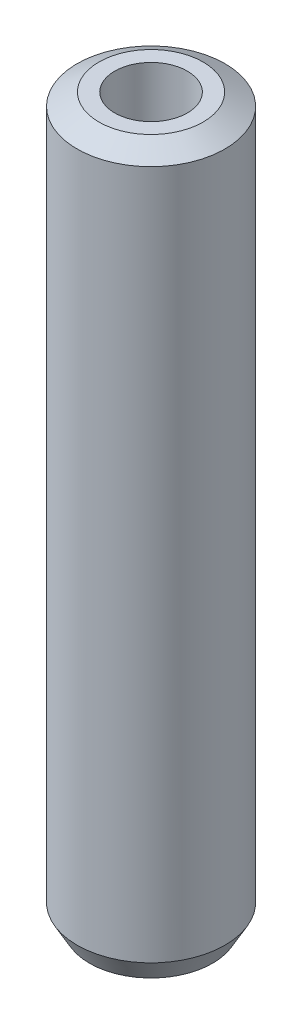
ISO-10303-21;
HEADER;
FILE_DESCRIPTION(('STEP AP214'),'2;1');
FILE_NAME('part.step','',(''),(''),'','','');
FILE_SCHEMA(('AUTOMOTIVE_DESIGN { 1 0 10303 214 1 1 1 1 }'));
ENDSEC;
DATA;
#1=APPLICATION_CONTEXT('core data for automotive mechanical design processes');
#2=APPLICATION_PROTOCOL_DEFINITION('international standard','automotive_design',2000,#1);
#3=PRODUCT_CONTEXT('',#1,'mechanical');
#4=PRODUCT('Part','Part','',(#3));
#5=PRODUCT_RELATED_PRODUCT_CATEGORY('part','',(#4));
#6=PRODUCT_DEFINITION_FORMATION('','',#4);
#7=PRODUCT_DEFINITION_CONTEXT('part definition',#1,'design');
#8=PRODUCT_DEFINITION('design','',#6,#7);
#9=PRODUCT_DEFINITION_SHAPE('','',#8);
#10=(LENGTH_UNIT() NAMED_UNIT(*) SI_UNIT(.MILLI.,.METRE.));
#11=(NAMED_UNIT(*) PLANE_ANGLE_UNIT() SI_UNIT($,.RADIAN.));
#12=(NAMED_UNIT(*) SI_UNIT($,.STERADIAN.) SOLID_ANGLE_UNIT());
#13=UNCERTAINTY_MEASURE_WITH_UNIT(LENGTH_MEASURE(1.E-05),#10,'distance_accuracy_value','');
#14=(GEOMETRIC_REPRESENTATION_CONTEXT(3) GLOBAL_UNCERTAINTY_ASSIGNED_CONTEXT((#13)) GLOBAL_UNIT_ASSIGNED_CONTEXT((#10,
#11,#12)) REPRESENTATION_CONTEXT('',''));
#15=CARTESIAN_POINT('',(0.,0.,0.));
#16=DIRECTION('',(0.,0.,1.));
#17=DIRECTION('',(1.,0.,0.));
#18=AXIS2_PLACEMENT_3D('',#15,#16,#17);
#19=CARTESIAN_POINT('',(0.,73.4033840317255,0.));
#20=DIRECTION('',(0.,-1.,0.));
#21=DIRECTION('',(0.,0.,-1.));
#22=AXIS2_PLACEMENT_3D('',#19,#20,#21);
#23=CYLINDRICAL_SURFACE('',#22,7.5);
#24=CARTESIAN_POINT('',(0.,72.1486161220734,0.));
#25=DIRECTION('',(0.,1.,0.));
#26=DIRECTION('',(0.,0.,1.));
#27=AXIS2_PLACEMENT_3D('',#24,#25,#26);
#28=CIRCLE('',#27,7.5);
#29=CARTESIAN_POINT('',(0.,72.1486161220734,-7.5));
#30=VERTEX_POINT('',#29);
#31=EDGE_CURVE('E50',#30,#30,#28,.F.);
#32=CARTESIAN_POINT('',(0.,2.2189670734282,0.));
#33=DIRECTION('',(0.,1.,0.));
#34=DIRECTION('',(0.,0.,1.));
#35=AXIS2_PLACEMENT_3D('',#32,#33,#34);
#36=CIRCLE('',#35,7.5);
#37=CARTESIAN_POINT('',(0.,2.2189670734282,-7.5));
#38=VERTEX_POINT('',#37);
#39=EDGE_CURVE('E51',#38,#38,#36,.T.);
#40=CARTESIAN_POINT('',(0.,72.1486161220734,-7.5));
#41=CARTESIAN_POINT('',(0.,71.4201822778167,-7.5));
#42=CARTESIAN_POINT('',(0.,70.69174843356,-7.5));
#43=CARTESIAN_POINT('',(0.,69.2348807450465,-7.5));
#44=CARTESIAN_POINT('',(0.,68.5064469007898,-7.5));
#45=CARTESIAN_POINT('',(0.,67.0495792122763,-7.5));
#46=CARTESIAN_POINT('',(0.,66.3211453680196,-7.5));
#47=CARTESIAN_POINT('',(0.,64.8642776795062,-7.5));
#48=CARTESIAN_POINT('',(0.,64.1358438352495,-7.5));
#49=CARTESIAN_POINT('',(0.,62.678976146736,-7.5));
#50=CARTESIAN_POINT('',(0.,61.9505423024793,-7.5));
#51=CARTESIAN_POINT('',(0.,60.4936746139659,-7.5));
#52=CARTESIAN_POINT('',(0.,59.7652407697091,-7.5));
#53=CARTESIAN_POINT('',(0.,58.3083730811957,-7.5));
#54=CARTESIAN_POINT('',(0.,57.579939236939,-7.5));
#55=CARTESIAN_POINT('',(0.,56.1230715484255,-7.5));
#56=CARTESIAN_POINT('',(0.,55.3946377041688,-7.5));
#57=CARTESIAN_POINT('',(0.,53.9377700156554,-7.5));
#58=CARTESIAN_POINT('',(0.,53.2093361713987,-7.5));
#59=CARTESIAN_POINT('',(0.,51.7524684828852,-7.5));
#60=CARTESIAN_POINT('',(0.,51.0240346386285,-7.5));
#61=CARTESIAN_POINT('',(0.,49.5671669501151,-7.5));
#62=CARTESIAN_POINT('',(0.,48.8387331058583,-7.5));
#63=CARTESIAN_POINT('',(0.,47.3818654173449,-7.5));
#64=CARTESIAN_POINT('',(0.,46.6534315730882,-7.5));
#65=CARTESIAN_POINT('',(0.,45.1965638845747,-7.5));
#66=CARTESIAN_POINT('',(0.,44.468130040318,-7.5));
#67=CARTESIAN_POINT('',(0.,43.0112623518046,-7.5));
#68=CARTESIAN_POINT('',(0.,42.2828285075478,-7.5));
#69=CARTESIAN_POINT('',(0.,40.8259608190344,-7.5));
#70=CARTESIAN_POINT('',(0.,40.0975269747777,-7.5));
#71=CARTESIAN_POINT('',(0.,38.6406592862642,-7.5));
#72=CARTESIAN_POINT('',(0.,37.9122254420075,-7.5));
#73=CARTESIAN_POINT('',(0.,36.4553577534941,-7.5));
#74=CARTESIAN_POINT('',(0.,35.7269239092374,-7.5));
#75=CARTESIAN_POINT('',(0.,34.2700562207239,-7.5));
#76=CARTESIAN_POINT('',(0.,33.5416223764672,-7.5));
#77=CARTESIAN_POINT('',(0.,32.0847546879538,-7.5));
#78=CARTESIAN_POINT('',(0.,31.356320843697,-7.5));
#79=CARTESIAN_POINT('',(0.,29.8994531551836,-7.5));
#80=CARTESIAN_POINT('',(0.,29.1710193109269,-7.5));
#81=CARTESIAN_POINT('',(0.,27.7141516224134,-7.5));
#82=CARTESIAN_POINT('',(0.,26.9857177781567,-7.5));
#83=CARTESIAN_POINT('',(0.,25.5288500896433,-7.5));
#84=CARTESIAN_POINT('',(0.,24.8004162453865,-7.5));
#85=CARTESIAN_POINT('',(0.,23.3435485568731,-7.5));
#86=CARTESIAN_POINT('',(0.,22.6151147126164,-7.5));
#87=CARTESIAN_POINT('',(0.,21.1582470241029,-7.5));
#88=CARTESIAN_POINT('',(0.,20.4298131798462,-7.5));
#89=CARTESIAN_POINT('',(0.,18.9729454913328,-7.5));
#90=CARTESIAN_POINT('',(0.,18.2445116470761,-7.5));
#91=CARTESIAN_POINT('',(0.,16.7876439585626,-7.5));
#92=CARTESIAN_POINT('',(0.,16.0592101143059,-7.5));
#93=CARTESIAN_POINT('',(0.,14.6023424257925,-7.5));
#94=CARTESIAN_POINT('',(0.,13.8739085815357,-7.5));
#95=CARTESIAN_POINT('',(0.,12.4170408930223,-7.5));
#96=CARTESIAN_POINT('',(0.,11.6886070487656,-7.5));
#97=CARTESIAN_POINT('',(0.,10.2317393602521,-7.5));
#98=CARTESIAN_POINT('',(0.,9.5033055159954,-7.5));
#99=CARTESIAN_POINT('',(0.,8.04643782748196,-7.5));
#100=CARTESIAN_POINT('',(0.,7.31800398322524,-7.5));
#101=CARTESIAN_POINT('',(0.,5.8611362947118,-7.5));
#102=CARTESIAN_POINT('',(0.,5.13270245045508,-7.5));
#103=CARTESIAN_POINT('',(0.,3.67583476194164,-7.5));
#104=CARTESIAN_POINT('',(0.,2.94740091768492,-7.5));
#105=CARTESIAN_POINT('',(0.,2.2189670734282,-7.5));
#106=B_SPLINE_CURVE_WITH_KNOTS('',3,(#40,#41,#42,#43,#44,#45,#46,#47,#48,#49,#50,#51,#52,#53,
#54,#55,#56,#57,#58,#59,#60,#61,#62,#63,#64,#65,#66,#67,#68,#69,#70,#71,#72,#73,#74,#75,#76,#77,
#78,#79,#80,#81,#82,#83,#84,#85,#86,#87,#88,#89,#90,#91,#92,#93,#94,#95,#96,#97,#98,#99,#100,
#101,#102,#103,#104,#105),.UNSPECIFIED.,.F.,.F.,(4,2,2,2,2,2,2,2,2,2,2,2,2,2,2,2,2,2,2,2,2,2,2,
2,2,2,2,2,2,2,2,2,4),(0.,2.18530153277016,4.37060306554032,6.55590459831049,8.74120613108065,
10.9265076638508,13.111809196621,15.2971107293911,17.4824122621613,19.6677137949315,
21.8530153277016,24.0383168604718,26.2236183932419,28.4089199260121,30.5942214587823,
32.7795229915524,34.9648245243226,37.1501260570928,39.3354275898629,41.5207291226331,
43.7060306554032,45.8913321881734,48.0766337209436,50.2619352537137,52.4472367864839,
54.6325383192541,56.8178398520242,59.0031413847944,61.1884429175646,63.3737444503347,
65.5590459831049,67.744347515875,69.9296490486452),.UNSPECIFIED.);
#107=EDGE_CURVE('BSEAM39',#30,#38,#106,.T.);
#108=ORIENTED_EDGE('',*,*,#31,.T.);
#109=ORIENTED_EDGE('',*,*,#39,.T.);
#110=ORIENTED_EDGE('',*,*,#107,.T.);
#111=ORIENTED_EDGE('',*,*,#107,.F.);
#112=EDGE_LOOP('',(#108,#110,#109,#111));
#113=FACE_BOUND('',#112,.T.);
#114=ADVANCED_FACE('F39',(#113),#23,.T.);
#115=CARTESIAN_POINT('',(0.,73.4033840317255,0.));
#116=DIRECTION('',(0.,1.,0.));
#117=DIRECTION('',(0.,0.,1.));
#118=AXIS2_PLACEMENT_3D('',#115,#116,#117);
#119=PLANE('',#118);
#120=CARTESIAN_POINT('',(0.,73.4033840317255,0.));
#121=DIRECTION('',(0.,1.,0.));
#122=DIRECTION('',(0.,0.,1.));
#123=AXIS2_PLACEMENT_3D('',#120,#121,#122);
#124=CIRCLE('',#123,5.28103292657194);
#125=CARTESIAN_POINT('',(0.,73.4033840317255,5.28103292657194));
#126=VERTEX_POINT('',#125);
#127=EDGE_CURVE('E54',#126,#126,#124,.T.);
#128=ORIENTED_EDGE('',*,*,#127,.T.);
#129=EDGE_LOOP('',(#128));
#130=FACE_BOUND('',#129,.T.);
#131=CARTESIAN_POINT('',(0.,73.4033840317255,0.));
#132=DIRECTION('',(0.,1.,0.));
#133=DIRECTION('',(0.,0.,1.));
#134=AXIS2_PLACEMENT_3D('',#131,#132,#133);
#135=CIRCLE('',#134,3.68130592260577);
#136=CARTESIAN_POINT('',(0.,73.4033840317255,-3.68130592260577));
#137=VERTEX_POINT('',#136);
#138=EDGE_CURVE('E58',#137,#137,#135,.T.);
#139=ORIENTED_EDGE('',*,*,#138,.F.);
#140=EDGE_LOOP('',(#139));
#141=FACE_BOUND('',#140,.T.);
#142=ADVANCED_FACE('F69',(#130,#141),#119,.T.);
#143=CARTESIAN_POINT('',(0.,0.,0.));
#144=DIRECTION('',(0.,1.,0.));
#145=DIRECTION('',(0.,0.,1.));
#146=AXIS2_PLACEMENT_3D('',#143,#144,#145);
#147=PLANE('',#146);
#148=CARTESIAN_POINT('',(0.,0.,0.));
#149=DIRECTION('',(0.,1.,0.));
#150=DIRECTION('',(0.,0.,1.));
#151=AXIS2_PLACEMENT_3D('',#148,#149,#150);
#152=CIRCLE('',#151,6.24523209034778);
#153=CARTESIAN_POINT('',(0.,0.,6.24523209034778));
#154=VERTEX_POINT('',#153);
#155=EDGE_CURVE('E10',#154,#154,#152,.F.);
#156=ORIENTED_EDGE('',*,*,#155,.T.);
#157=EDGE_LOOP('',(#156));
#158=FACE_BOUND('',#157,.T.);
#159=CARTESIAN_POINT('',(0.,0.,0.));
#160=DIRECTION('',(0.,1.,0.));
#161=DIRECTION('',(0.,0.,1.));
#162=AXIS2_PLACEMENT_3D('',#159,#160,#161);
#163=CIRCLE('',#162,3.68130592260577);
#164=CARTESIAN_POINT('',(0.,0.,-3.68130592260577));
#165=VERTEX_POINT('',#164);
#166=EDGE_CURVE('E63',#165,#165,#163,.T.);
#167=ORIENTED_EDGE('',*,*,#166,.T.);
#168=EDGE_LOOP('',(#167));
#169=FACE_BOUND('',#168,.T.);
#170=ADVANCED_FACE('F75',(#158,#169),#147,.F.);
#171=CARTESIAN_POINT('',(0.,73.4033840317255,0.));
#172=DIRECTION('',(0.,-1.,0.));
#173=DIRECTION('',(0.,0.,-1.));
#174=AXIS2_PLACEMENT_3D('',#171,#172,#173);
#175=CYLINDRICAL_SURFACE('',#174,3.68130592260577);
#176=CARTESIAN_POINT('',(0.,73.4033840317255,-3.68130592260577));
#177=CARTESIAN_POINT('',(0.,72.6387654480617,-3.68130592260577));
#178=CARTESIAN_POINT('',(0.,71.8741468643979,-3.68130592260577));
#179=CARTESIAN_POINT('',(0.,70.3449096970703,-3.68130592260577));
#180=CARTESIAN_POINT('',(0.,69.5802911134065,-3.68130592260577));
#181=CARTESIAN_POINT('',(0.,68.0510539460789,-3.68130592260577));
#182=CARTESIAN_POINT('',(0.,67.2864353624151,-3.68130592260577));
#183=CARTESIAN_POINT('',(0.,65.7571981950875,-3.68130592260577));
#184=CARTESIAN_POINT('',(0.,64.9925796114236,-3.68130592260577));
#185=CARTESIAN_POINT('',(0.,63.463342444096,-3.68130592260577));
#186=CARTESIAN_POINT('',(0.,62.6987238604322,-3.68130592260577));
#187=CARTESIAN_POINT('',(0.,61.1694866931046,-3.68130592260577));
#188=CARTESIAN_POINT('',(0.,60.4048681094408,-3.68130592260577));
#189=CARTESIAN_POINT('',(0.,58.8756309421132,-3.68130592260577));
#190=CARTESIAN_POINT('',(0.,58.1110123584494,-3.68130592260577));
#191=CARTESIAN_POINT('',(0.,56.5817751911218,-3.68130592260577));
#192=CARTESIAN_POINT('',(0.,55.817156607458,-3.68130592260577));
#193=CARTESIAN_POINT('',(0.,54.2879194401303,-3.68130592260577));
#194=CARTESIAN_POINT('',(0.,53.5233008564665,-3.68130592260577));
#195=CARTESIAN_POINT('',(0.,51.9940636891389,-3.68130592260577));
#196=CARTESIAN_POINT('',(0.,51.2294451054751,-3.68130592260577));
#197=CARTESIAN_POINT('',(0.,49.7002079381475,-3.68130592260577));
#198=CARTESIAN_POINT('',(0.,48.9355893544837,-3.68130592260577));
#199=CARTESIAN_POINT('',(0.,47.4063521871561,-3.68130592260577));
#200=CARTESIAN_POINT('',(0.,46.6417336034923,-3.68130592260577));
#201=CARTESIAN_POINT('',(0.,45.1124964361646,-3.68130592260577));
#202=CARTESIAN_POINT('',(0.,44.3478778525008,-3.68130592260577));
#203=CARTESIAN_POINT('',(0.,42.8186406851732,-3.68130592260577));
#204=CARTESIAN_POINT('',(0.,42.0540221015094,-3.68130592260577));
#205=CARTESIAN_POINT('',(0.,40.5247849341818,-3.68130592260577));
#206=CARTESIAN_POINT('',(0.,39.760166350518,-3.68130592260577));
#207=CARTESIAN_POINT('',(0.,38.2309291831904,-3.68130592260577));
#208=CARTESIAN_POINT('',(0.,37.4663105995266,-3.68130592260577));
#209=CARTESIAN_POINT('',(0.,35.937073432199,-3.68130592260577));
#210=CARTESIAN_POINT('',(0.,35.1724548485351,-3.68130592260577));
#211=CARTESIAN_POINT('',(0.,33.6432176812075,-3.68130592260577));
#212=CARTESIAN_POINT('',(0.,32.8785990975437,-3.68130592260577));
#213=CARTESIAN_POINT('',(0.,31.3493619302161,-3.68130592260577));
#214=CARTESIAN_POINT('',(0.,30.5847433465523,-3.68130592260577));
#215=CARTESIAN_POINT('',(0.,29.0555061792247,-3.68130592260577));
#216=CARTESIAN_POINT('',(0.,28.2908875955609,-3.68130592260577));
#217=CARTESIAN_POINT('',(0.,26.7616504282333,-3.68130592260577));
#218=CARTESIAN_POINT('',(0.,25.9970318445695,-3.68130592260577));
#219=CARTESIAN_POINT('',(0.,24.4677946772418,-3.68130592260577));
#220=CARTESIAN_POINT('',(0.,23.703176093578,-3.68130592260577));
#221=CARTESIAN_POINT('',(0.,22.1739389262504,-3.68130592260577));
#222=CARTESIAN_POINT('',(0.,21.4093203425866,-3.68130592260577));
#223=CARTESIAN_POINT('',(0.,19.880083175259,-3.68130592260577));
#224=CARTESIAN_POINT('',(0.,19.1154645915952,-3.68130592260577));
#225=CARTESIAN_POINT('',(0.,17.5862274242676,-3.68130592260577));
#226=CARTESIAN_POINT('',(0.,16.8216088406038,-3.68130592260577));
#227=CARTESIAN_POINT('',(0.,15.2923716732761,-3.68130592260577));
#228=CARTESIAN_POINT('',(0.,14.5277530896123,-3.68130592260577));
#229=CARTESIAN_POINT('',(0.,12.9985159222847,-3.68130592260577));
#230=CARTESIAN_POINT('',(0.,12.2338973386209,-3.68130592260577));
#231=CARTESIAN_POINT('',(0.,10.7046601712933,-3.68130592260577));
#232=CARTESIAN_POINT('',(0.,9.9400415876295,-3.68130592260577));
#233=CARTESIAN_POINT('',(0.,8.41080442030188,-3.68130592260577));
#234=CARTESIAN_POINT('',(0.,7.64618583663808,-3.68130592260577));
#235=CARTESIAN_POINT('',(0.,6.11694866931047,-3.68130592260577));
#236=CARTESIAN_POINT('',(0.,5.35233008564666,-3.68130592260577));
#237=CARTESIAN_POINT('',(0.,3.82309291831904,-3.68130592260577));
#238=CARTESIAN_POINT('',(0.,3.05847433465523,-3.68130592260577));
#239=CARTESIAN_POINT('',(0.,1.52923716732761,-3.68130592260577));
#240=CARTESIAN_POINT('',(0.,0.764618583663806,-3.68130592260577));
#241=CARTESIAN_POINT('',(0.,0.,-3.68130592260577));
#242=B_SPLINE_CURVE_WITH_KNOTS('',3,(#176,#177,#178,#179,#180,#181,#182,#183,#184,#185,#186,
#187,#188,#189,#190,#191,#192,#193,#194,#195,#196,#197,#198,#199,#200,#201,#202,#203,#204,#205,
#206,#207,#208,#209,#210,#211,#212,#213,#214,#215,#216,#217,#218,#219,#220,#221,#222,#223,#224,
#225,#226,#227,#228,#229,#230,#231,#232,#233,#234,#235,#236,#237,#238,#239,#240,#241),
.UNSPECIFIED.,.F.,.F.,(4,2,2,2,2,2,2,2,2,2,2,2,2,2,2,2,2,2,2,2,2,2,2,2,2,2,2,2,2,2,2,2,4),(0.,
2.29385575099143,4.58771150198285,6.88156725297427,9.1754230039657,11.4692787549571,
13.7631345059485,16.05699025694,18.3508460079314,20.6447017589228,22.9385575099142,
25.2324132609057,27.5262690118971,29.8201247628885,32.1139805138799,34.4078362648713,
36.7016920158628,38.9955477668542,41.2894035178456,43.583259268837,45.8771150198285,
48.1709707708199,50.4648265218113,52.7586822728027,55.0525380237942,57.3463937747856,
59.640249525777,61.9341052767684,64.2279610277598,66.5218167787513,68.8156725297427,
71.1095282807341,73.4033840317255),.UNSPECIFIED.);
#243=EDGE_CURVE('BSEAM70',#137,#165,#242,.T.);
#244=ORIENTED_EDGE('',*,*,#138,.T.);
#245=ORIENTED_EDGE('',*,*,#166,.F.);
#246=ORIENTED_EDGE('',*,*,#243,.T.);
#247=ORIENTED_EDGE('',*,*,#243,.F.);
#248=EDGE_LOOP('',(#244,#246,#245,#247));
#249=FACE_BOUND('',#248,.T.);
#250=ADVANCED_FACE('F70',(#249),#175,.F.);
#251=CARTESIAN_POINT('',(0.,73.4033840317255,0.));
#252=DIRECTION('',(0.,-1.,0.));
#253=DIRECTION('',(0.,0.,-1.));
#254=AXIS2_PLACEMENT_3D('',#251,#252,#253);
#255=CONICAL_SURFACE('',#254,5.28103292657194,1.05615065126871);
#256=ORIENTED_EDGE('',*,*,#31,.F.);
#257=EDGE_LOOP('',(#256));
#258=FACE_BOUND('',#257,.T.);
#259=ORIENTED_EDGE('',*,*,#127,.F.);
#260=EDGE_LOOP('',(#259));
#261=FACE_BOUND('',#260,.T.);
#262=ADVANCED_FACE('F81',(#258,#261),#255,.T.);
#263=CARTESIAN_POINT('',(0.,2.2189670734282,0.));
#264=DIRECTION('',(0.,1.,0.));
#265=DIRECTION('',(0.,0.,1.));
#266=AXIS2_PLACEMENT_3D('',#263,#264,#265);
#267=CONICAL_SURFACE('',#266,7.5,0.514645675526185);
#268=ORIENTED_EDGE('',*,*,#155,.F.);
#269=EDGE_LOOP('',(#268));
#270=FACE_BOUND('',#269,.T.);
#271=ORIENTED_EDGE('',*,*,#39,.F.);
#272=EDGE_LOOP('',(#271));
#273=FACE_BOUND('',#272,.T.);
#274=ADVANCED_FACE('F45',(#270,#273),#267,.T.);
#275=CLOSED_SHELL('',(#114,#142,#170,#250,#262,#274));
#276=MANIFOLD_SOLID_BREP('B2',#275);
#277=ADVANCED_BREP_SHAPE_REPRESENTATION('',(#18,#276),#14);
#278=SHAPE_DEFINITION_REPRESENTATION(#9,#277);
ENDSEC;
END-ISO-10303-21;
